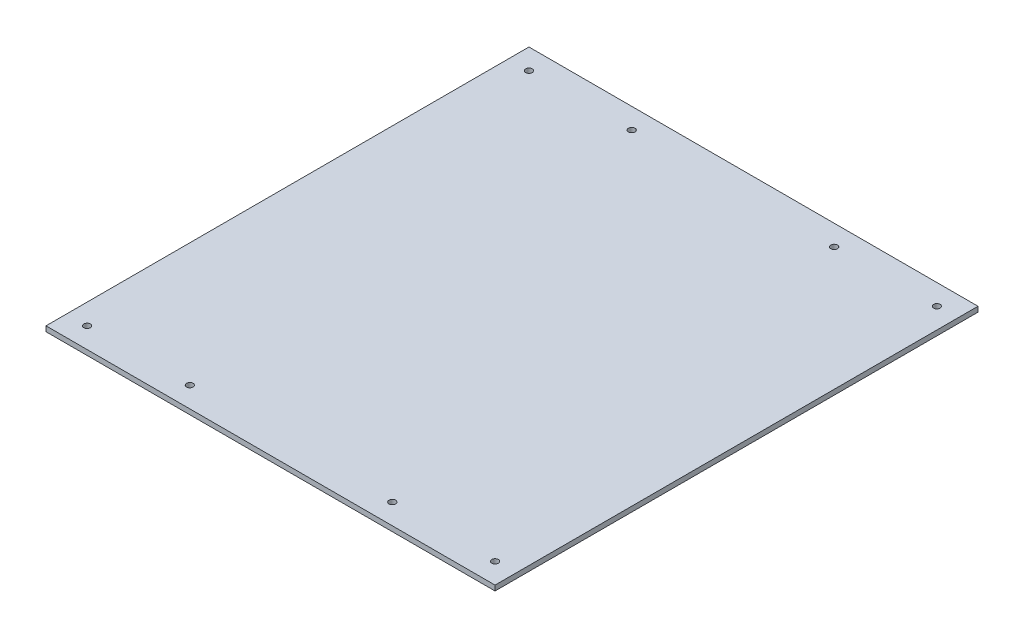
ISO-10303-21;
HEADER;
FILE_DESCRIPTION(('STEP AP214'),'2;1');
FILE_NAME('part.step','',(''),(''),'','','');
FILE_SCHEMA(('AUTOMOTIVE_DESIGN { 1 0 10303 214 1 1 1 1 }'));
ENDSEC;
DATA;
#1=APPLICATION_CONTEXT('core data for automotive mechanical design processes');
#2=APPLICATION_PROTOCOL_DEFINITION('international standard','automotive_design',2000,#1);
#3=PRODUCT_CONTEXT('',#1,'mechanical');
#4=PRODUCT('Part','Part','',(#3));
#5=PRODUCT_RELATED_PRODUCT_CATEGORY('part','',(#4));
#6=PRODUCT_DEFINITION_FORMATION('','',#4);
#7=PRODUCT_DEFINITION_CONTEXT('part definition',#1,'design');
#8=PRODUCT_DEFINITION('design','',#6,#7);
#9=PRODUCT_DEFINITION_SHAPE('','',#8);
#10=(LENGTH_UNIT() NAMED_UNIT(*) SI_UNIT(.MILLI.,.METRE.));
#11=(NAMED_UNIT(*) PLANE_ANGLE_UNIT() SI_UNIT($,.RADIAN.));
#12=(NAMED_UNIT(*) SI_UNIT($,.STERADIAN.) SOLID_ANGLE_UNIT());
#13=UNCERTAINTY_MEASURE_WITH_UNIT(LENGTH_MEASURE(1.E-05),#10,'distance_accuracy_value','');
#14=(GEOMETRIC_REPRESENTATION_CONTEXT(3) GLOBAL_UNCERTAINTY_ASSIGNED_CONTEXT((#13)) GLOBAL_UNIT_ASSIGNED_CONTEXT((#10,
#11,#12)) REPRESENTATION_CONTEXT('',''));
#15=CARTESIAN_POINT('',(0.,0.,0.));
#16=DIRECTION('',(0.,0.,1.));
#17=DIRECTION('',(1.,0.,0.));
#18=AXIS2_PLACEMENT_3D('',#15,#16,#17);
#19=CARTESIAN_POINT('',(218.5,5.,235.));
#20=DIRECTION('',(-1.,0.,0.));
#21=DIRECTION('',(0.,0.,1.));
#22=AXIS2_PLACEMENT_3D('',#19,#20,#21);
#23=PLANE('',#22);
#24=DIRECTION('',(0.,0.,-1.));
#25=VECTOR('',#24,1.);
#26=CARTESIAN_POINT('',(218.5,0.,235.));
#27=LINE('',#26,#25);
#28=CARTESIAN_POINT('',(218.5,0.,235.));
#29=VERTEX_POINT('',#28);
#30=CARTESIAN_POINT('',(218.5,0.,-235.));
#31=VERTEX_POINT('',#30);
#32=EDGE_CURVE('E98',#29,#31,#27,.T.);
#33=ORIENTED_EDGE('',*,*,#32,.T.);
#34=DIRECTION('',(0.,-1.,0.));
#35=VECTOR('',#34,1.);
#36=CARTESIAN_POINT('',(218.5,5.,-235.));
#37=LINE('',#36,#35);
#38=CARTESIAN_POINT('',(218.5,5.,-235.));
#39=VERTEX_POINT('',#38);
#40=EDGE_CURVE('E11',#39,#31,#37,.T.);
#41=ORIENTED_EDGE('',*,*,#40,.F.);
#42=DIRECTION('',(0.,0.,-1.));
#43=VECTOR('',#42,1.);
#44=CARTESIAN_POINT('',(218.5,5.,235.));
#45=LINE('',#44,#43);
#46=CARTESIAN_POINT('',(218.5,5.,235.));
#47=VERTEX_POINT('',#46);
#48=EDGE_CURVE('E85',#47,#39,#45,.T.);
#49=ORIENTED_EDGE('',*,*,#48,.F.);
#50=DIRECTION('',(0.,-1.,0.));
#51=VECTOR('',#50,1.);
#52=CARTESIAN_POINT('',(218.5,5.,235.));
#53=LINE('',#52,#51);
#54=EDGE_CURVE('E94',#47,#29,#53,.T.);
#55=ORIENTED_EDGE('',*,*,#54,.T.);
#56=EDGE_LOOP('',(#33,#41,#49,#55));
#57=FACE_BOUND('',#56,.T.);
#58=ADVANCED_FACE('F32',(#57),#23,.F.);
#59=CARTESIAN_POINT('',(-218.5,5.,-235.));
#60=DIRECTION('',(0.,0.,1.));
#61=DIRECTION('',(1.,0.,0.));
#62=AXIS2_PLACEMENT_3D('',#59,#60,#61);
#63=PLANE('',#62);
#64=DIRECTION('',(-1.,0.,0.));
#65=VECTOR('',#64,1.);
#66=CARTESIAN_POINT('',(-218.5,0.,-235.));
#67=LINE('',#66,#65);
#68=CARTESIAN_POINT('',(-218.5,0.,-235.));
#69=VERTEX_POINT('',#68);
#70=EDGE_CURVE('E89',#31,#69,#67,.T.);
#71=ORIENTED_EDGE('',*,*,#70,.T.);
#72=DIRECTION('',(0.,-1.,0.));
#73=VECTOR('',#72,1.);
#74=CARTESIAN_POINT('',(-218.5,5.,-235.));
#75=LINE('',#74,#73);
#76=CARTESIAN_POINT('',(-218.5,5.,-235.));
#77=VERTEX_POINT('',#76);
#78=EDGE_CURVE('E41',#77,#69,#75,.T.);
#79=ORIENTED_EDGE('',*,*,#78,.F.);
#80=DIRECTION('',(-1.,0.,0.));
#81=VECTOR('',#80,1.);
#82=CARTESIAN_POINT('',(-218.5,5.,-235.));
#83=LINE('',#82,#81);
#84=EDGE_CURVE('E80',#39,#77,#83,.T.);
#85=ORIENTED_EDGE('',*,*,#84,.F.);
#86=ORIENTED_EDGE('',*,*,#40,.T.);
#87=EDGE_LOOP('',(#71,#79,#85,#86));
#88=FACE_BOUND('',#87,.T.);
#89=ADVANCED_FACE('F88',(#88),#63,.F.);
#90=CARTESIAN_POINT('',(-218.5,5.,235.));
#91=DIRECTION('',(1.,0.,0.));
#92=DIRECTION('',(0.,0.,-1.));
#93=AXIS2_PLACEMENT_3D('',#90,#91,#92);
#94=PLANE('',#93);
#95=DIRECTION('',(0.,0.,1.));
#96=VECTOR('',#95,1.);
#97=CARTESIAN_POINT('',(-218.5,0.,235.));
#98=LINE('',#97,#96);
#99=CARTESIAN_POINT('',(-218.5,0.,235.));
#100=VERTEX_POINT('',#99);
#101=EDGE_CURVE('E67',#69,#100,#98,.T.);
#102=ORIENTED_EDGE('',*,*,#101,.T.);
#103=DIRECTION('',(0.,-1.,0.));
#104=VECTOR('',#103,1.);
#105=CARTESIAN_POINT('',(-218.5,5.,235.));
#106=LINE('',#105,#104);
#107=CARTESIAN_POINT('',(-218.5,5.,235.));
#108=VERTEX_POINT('',#107);
#109=EDGE_CURVE('E90',#108,#100,#106,.T.);
#110=ORIENTED_EDGE('',*,*,#109,.F.);
#111=DIRECTION('',(0.,0.,1.));
#112=VECTOR('',#111,1.);
#113=CARTESIAN_POINT('',(-218.5,5.,235.));
#114=LINE('',#113,#112);
#115=EDGE_CURVE('E83',#77,#108,#114,.T.);
#116=ORIENTED_EDGE('',*,*,#115,.F.);
#117=ORIENTED_EDGE('',*,*,#78,.T.);
#118=EDGE_LOOP('',(#102,#110,#116,#117));
#119=FACE_BOUND('',#118,.T.);
#120=ADVANCED_FACE('F92',(#119),#94,.F.);
#121=CARTESIAN_POINT('',(-218.5,5.,235.));
#122=DIRECTION('',(0.,0.,-1.));
#123=DIRECTION('',(-1.,0.,0.));
#124=AXIS2_PLACEMENT_3D('',#121,#122,#123);
#125=PLANE('',#124);
#126=DIRECTION('',(1.,0.,0.));
#127=VECTOR('',#126,1.);
#128=CARTESIAN_POINT('',(-218.5,0.,235.));
#129=LINE('',#128,#127);
#130=EDGE_CURVE('E73',#100,#29,#129,.T.);
#131=ORIENTED_EDGE('',*,*,#130,.T.);
#132=ORIENTED_EDGE('',*,*,#54,.F.);
#133=DIRECTION('',(1.,0.,0.));
#134=VECTOR('',#133,1.);
#135=CARTESIAN_POINT('',(-218.5,5.,235.));
#136=LINE('',#135,#134);
#137=EDGE_CURVE('E50',#108,#47,#136,.T.);
#138=ORIENTED_EDGE('',*,*,#137,.F.);
#139=ORIENTED_EDGE('',*,*,#109,.T.);
#140=EDGE_LOOP('',(#131,#132,#138,#139));
#141=FACE_BOUND('',#140,.T.);
#142=ADVANCED_FACE('F159',(#141),#125,.F.);
#143=CARTESIAN_POINT('',(0.,5.,0.));
#144=DIRECTION('',(0.,-1.,0.));
#145=DIRECTION('',(0.,0.,-1.));
#146=AXIS2_PLACEMENT_3D('',#143,#144,#145);
#147=PLANE('',#146);
#148=CARTESIAN_POINT('',(-198.5,5.,-215.));
#149=DIRECTION('',(0.,1.,0.));
#150=DIRECTION('',(0.,0.,1.));
#151=AXIS2_PLACEMENT_3D('',#148,#149,#150);
#152=CIRCLE('',#151,3.20000000000001);
#153=CARTESIAN_POINT('',(-198.5,5.,-211.8));
#154=VERTEX_POINT('',#153);
#155=EDGE_CURVE('E141',#154,#154,#152,.T.);
#156=ORIENTED_EDGE('',*,*,#155,.F.);
#157=EDGE_LOOP('',(#156));
#158=FACE_BOUND('',#157,.T.);
#159=CARTESIAN_POINT('',(-98.5,5.,-215.));
#160=DIRECTION('',(0.,1.,0.));
#161=DIRECTION('',(0.,0.,1.));
#162=AXIS2_PLACEMENT_3D('',#159,#160,#161);
#163=CIRCLE('',#162,3.19999999999999);
#164=CARTESIAN_POINT('',(-98.5,5.,-211.8));
#165=VERTEX_POINT('',#164);
#166=EDGE_CURVE('E131',#165,#165,#163,.T.);
#167=ORIENTED_EDGE('',*,*,#166,.F.);
#168=EDGE_LOOP('',(#167));
#169=FACE_BOUND('',#168,.T.);
#170=CARTESIAN_POINT('',(98.5,5.,-215.));
#171=DIRECTION('',(0.,1.,0.));
#172=DIRECTION('',(0.,0.,1.));
#173=AXIS2_PLACEMENT_3D('',#170,#171,#172);
#174=CIRCLE('',#173,3.19999999999999);
#175=CARTESIAN_POINT('',(98.5,5.,-211.8));
#176=VERTEX_POINT('',#175);
#177=EDGE_CURVE('E128',#176,#176,#174,.T.);
#178=ORIENTED_EDGE('',*,*,#177,.F.);
#179=EDGE_LOOP('',(#178));
#180=FACE_BOUND('',#179,.T.);
#181=CARTESIAN_POINT('',(198.5,5.,-215.));
#182=DIRECTION('',(0.,1.,0.));
#183=DIRECTION('',(0.,0.,1.));
#184=AXIS2_PLACEMENT_3D('',#181,#182,#183);
#185=CIRCLE('',#184,3.20000000000001);
#186=CARTESIAN_POINT('',(198.5,5.,-211.8));
#187=VERTEX_POINT('',#186);
#188=EDGE_CURVE('E125',#187,#187,#185,.T.);
#189=ORIENTED_EDGE('',*,*,#188,.F.);
#190=EDGE_LOOP('',(#189));
#191=FACE_BOUND('',#190,.T.);
#192=CARTESIAN_POINT('',(-198.5,5.,215.));
#193=DIRECTION('',(0.,1.,0.));
#194=DIRECTION('',(0.,0.,1.));
#195=AXIS2_PLACEMENT_3D('',#192,#193,#194);
#196=CIRCLE('',#195,3.20000000000001);
#197=CARTESIAN_POINT('',(-198.5,5.,218.2));
#198=VERTEX_POINT('',#197);
#199=EDGE_CURVE('E121',#198,#198,#196,.T.);
#200=ORIENTED_EDGE('',*,*,#199,.F.);
#201=EDGE_LOOP('',(#200));
#202=FACE_BOUND('',#201,.T.);
#203=CARTESIAN_POINT('',(-98.5,5.,215.));
#204=DIRECTION('',(0.,1.,0.));
#205=DIRECTION('',(0.,0.,1.));
#206=AXIS2_PLACEMENT_3D('',#203,#204,#205);
#207=CIRCLE('',#206,3.19999999999999);
#208=CARTESIAN_POINT('',(-98.5,5.,218.2));
#209=VERTEX_POINT('',#208);
#210=EDGE_CURVE('E117',#209,#209,#207,.T.);
#211=ORIENTED_EDGE('',*,*,#210,.F.);
#212=EDGE_LOOP('',(#211));
#213=FACE_BOUND('',#212,.T.);
#214=CARTESIAN_POINT('',(98.5,5.,215.));
#215=DIRECTION('',(0.,1.,0.));
#216=DIRECTION('',(0.,0.,1.));
#217=AXIS2_PLACEMENT_3D('',#214,#215,#216);
#218=CIRCLE('',#217,3.19999999999999);
#219=CARTESIAN_POINT('',(98.5,5.,218.2));
#220=VERTEX_POINT('',#219);
#221=EDGE_CURVE('E113',#220,#220,#218,.T.);
#222=ORIENTED_EDGE('',*,*,#221,.F.);
#223=EDGE_LOOP('',(#222));
#224=FACE_BOUND('',#223,.T.);
#225=CARTESIAN_POINT('',(198.5,5.,215.));
#226=DIRECTION('',(0.,1.,0.));
#227=DIRECTION('',(0.,0.,1.));
#228=AXIS2_PLACEMENT_3D('',#225,#226,#227);
#229=CIRCLE('',#228,3.20000000000001);
#230=CARTESIAN_POINT('',(198.5,5.,218.2));
#231=VERTEX_POINT('',#230);
#232=EDGE_CURVE('E109',#231,#231,#229,.T.);
#233=ORIENTED_EDGE('',*,*,#232,.F.);
#234=EDGE_LOOP('',(#233));
#235=FACE_BOUND('',#234,.T.);
#236=ORIENTED_EDGE('',*,*,#48,.T.);
#237=ORIENTED_EDGE('',*,*,#84,.T.);
#238=ORIENTED_EDGE('',*,*,#115,.T.);
#239=ORIENTED_EDGE('',*,*,#137,.T.);
#240=EDGE_LOOP('',(#236,#237,#238,#239));
#241=FACE_BOUND('',#240,.T.);
#242=ADVANCED_FACE('F81',(#158,#169,#180,#191,#202,#213,#224,#235,#241),#147,.F.);
#243=CARTESIAN_POINT('',(0.,0.,0.));
#244=DIRECTION('',(0.,-1.,0.));
#245=DIRECTION('',(0.,0.,-1.));
#246=AXIS2_PLACEMENT_3D('',#243,#244,#245);
#247=PLANE('',#246);
#248=CARTESIAN_POINT('',(-198.5,0.,-215.));
#249=DIRECTION('',(0.,-1.,0.));
#250=DIRECTION('',(0.,0.,-1.));
#251=AXIS2_PLACEMENT_3D('',#248,#249,#250);
#252=CIRCLE('',#251,3.20000000000001);
#253=CARTESIAN_POINT('',(-198.5,0.,-218.2));
#254=VERTEX_POINT('',#253);
#255=EDGE_CURVE('E35',#254,#254,#252,.T.);
#256=ORIENTED_EDGE('',*,*,#255,.F.);
#257=EDGE_LOOP('',(#256));
#258=FACE_BOUND('',#257,.T.);
#259=CARTESIAN_POINT('',(-98.5,0.,-215.));
#260=DIRECTION('',(0.,-1.,0.));
#261=DIRECTION('',(0.,0.,-1.));
#262=AXIS2_PLACEMENT_3D('',#259,#260,#261);
#263=CIRCLE('',#262,3.19999999999999);
#264=CARTESIAN_POINT('',(-98.5,0.,-218.2));
#265=VERTEX_POINT('',#264);
#266=EDGE_CURVE('E129',#265,#265,#263,.T.);
#267=ORIENTED_EDGE('',*,*,#266,.F.);
#268=EDGE_LOOP('',(#267));
#269=FACE_BOUND('',#268,.T.);
#270=CARTESIAN_POINT('',(98.5,0.,-215.));
#271=DIRECTION('',(0.,-1.,0.));
#272=DIRECTION('',(0.,0.,-1.));
#273=AXIS2_PLACEMENT_3D('',#270,#271,#272);
#274=CIRCLE('',#273,3.19999999999999);
#275=CARTESIAN_POINT('',(98.5,0.,-218.2));
#276=VERTEX_POINT('',#275);
#277=EDGE_CURVE('E126',#276,#276,#274,.T.);
#278=ORIENTED_EDGE('',*,*,#277,.F.);
#279=EDGE_LOOP('',(#278));
#280=FACE_BOUND('',#279,.T.);
#281=CARTESIAN_POINT('',(198.5,0.,-215.));
#282=DIRECTION('',(0.,-1.,0.));
#283=DIRECTION('',(0.,0.,-1.));
#284=AXIS2_PLACEMENT_3D('',#281,#282,#283);
#285=CIRCLE('',#284,3.20000000000001);
#286=CARTESIAN_POINT('',(198.5,0.,-218.2));
#287=VERTEX_POINT('',#286);
#288=EDGE_CURVE('E122',#287,#287,#285,.T.);
#289=ORIENTED_EDGE('',*,*,#288,.F.);
#290=EDGE_LOOP('',(#289));
#291=FACE_BOUND('',#290,.T.);
#292=CARTESIAN_POINT('',(-198.5,0.,215.));
#293=DIRECTION('',(0.,-1.,0.));
#294=DIRECTION('',(0.,0.,-1.));
#295=AXIS2_PLACEMENT_3D('',#292,#293,#294);
#296=CIRCLE('',#295,3.20000000000001);
#297=CARTESIAN_POINT('',(-198.5,0.,211.8));
#298=VERTEX_POINT('',#297);
#299=EDGE_CURVE('E118',#298,#298,#296,.T.);
#300=ORIENTED_EDGE('',*,*,#299,.F.);
#301=EDGE_LOOP('',(#300));
#302=FACE_BOUND('',#301,.T.);
#303=CARTESIAN_POINT('',(-98.5,0.,215.));
#304=DIRECTION('',(0.,-1.,0.));
#305=DIRECTION('',(0.,0.,-1.));
#306=AXIS2_PLACEMENT_3D('',#303,#304,#305);
#307=CIRCLE('',#306,3.19999999999999);
#308=CARTESIAN_POINT('',(-98.5,0.,211.8));
#309=VERTEX_POINT('',#308);
#310=EDGE_CURVE('E114',#309,#309,#307,.T.);
#311=ORIENTED_EDGE('',*,*,#310,.F.);
#312=EDGE_LOOP('',(#311));
#313=FACE_BOUND('',#312,.T.);
#314=CARTESIAN_POINT('',(98.5,0.,215.));
#315=DIRECTION('',(0.,-1.,0.));
#316=DIRECTION('',(0.,0.,-1.));
#317=AXIS2_PLACEMENT_3D('',#314,#315,#316);
#318=CIRCLE('',#317,3.19999999999999);
#319=CARTESIAN_POINT('',(98.5,0.,211.8));
#320=VERTEX_POINT('',#319);
#321=EDGE_CURVE('E110',#320,#320,#318,.T.);
#322=ORIENTED_EDGE('',*,*,#321,.F.);
#323=EDGE_LOOP('',(#322));
#324=FACE_BOUND('',#323,.T.);
#325=CARTESIAN_POINT('',(198.5,0.,215.));
#326=DIRECTION('',(0.,-1.,0.));
#327=DIRECTION('',(0.,0.,-1.));
#328=AXIS2_PLACEMENT_3D('',#325,#326,#327);
#329=CIRCLE('',#328,3.20000000000001);
#330=CARTESIAN_POINT('',(198.5,0.,211.8));
#331=VERTEX_POINT('',#330);
#332=EDGE_CURVE('E101',#331,#331,#329,.T.);
#333=ORIENTED_EDGE('',*,*,#332,.F.);
#334=EDGE_LOOP('',(#333));
#335=FACE_BOUND('',#334,.T.);
#336=ORIENTED_EDGE('',*,*,#32,.F.);
#337=ORIENTED_EDGE('',*,*,#130,.F.);
#338=ORIENTED_EDGE('',*,*,#101,.F.);
#339=ORIENTED_EDGE('',*,*,#70,.F.);
#340=EDGE_LOOP('',(#336,#337,#338,#339));
#341=FACE_BOUND('',#340,.T.);
#342=ADVANCED_FACE('F158',(#258,#269,#280,#291,#302,#313,#324,#335,#341),#247,.T.);
#343=CARTESIAN_POINT('',(198.5,5.,215.));
#344=DIRECTION('',(0.,1.,0.));
#345=DIRECTION('',(0.,0.,1.));
#346=AXIS2_PLACEMENT_3D('',#343,#344,#345);
#347=CYLINDRICAL_SURFACE('',#346,3.20000000000001);
#348=ORIENTED_EDGE('',*,*,#332,.T.);
#349=EDGE_LOOP('',(#348));
#350=FACE_BOUND('',#349,.T.);
#351=ORIENTED_EDGE('',*,*,#232,.T.);
#352=EDGE_LOOP('',(#351));
#353=FACE_BOUND('',#352,.T.);
#354=ADVANCED_FACE('F155',(#350,#353),#347,.F.);
#355=CARTESIAN_POINT('',(98.5,5.,215.));
#356=DIRECTION('',(0.,1.,0.));
#357=DIRECTION('',(0.,0.,1.));
#358=AXIS2_PLACEMENT_3D('',#355,#356,#357);
#359=CYLINDRICAL_SURFACE('',#358,3.19999999999999);
#360=ORIENTED_EDGE('',*,*,#321,.T.);
#361=EDGE_LOOP('',(#360));
#362=FACE_BOUND('',#361,.T.);
#363=ORIENTED_EDGE('',*,*,#221,.T.);
#364=EDGE_LOOP('',(#363));
#365=FACE_BOUND('',#364,.T.);
#366=ADVANCED_FACE('F208',(#362,#365),#359,.F.);
#367=CARTESIAN_POINT('',(-98.5,5.,215.));
#368=DIRECTION('',(0.,1.,0.));
#369=DIRECTION('',(0.,0.,1.));
#370=AXIS2_PLACEMENT_3D('',#367,#368,#369);
#371=CYLINDRICAL_SURFACE('',#370,3.19999999999999);
#372=ORIENTED_EDGE('',*,*,#310,.T.);
#373=EDGE_LOOP('',(#372));
#374=FACE_BOUND('',#373,.T.);
#375=ORIENTED_EDGE('',*,*,#210,.T.);
#376=EDGE_LOOP('',(#375));
#377=FACE_BOUND('',#376,.T.);
#378=ADVANCED_FACE('F217',(#374,#377),#371,.F.);
#379=CARTESIAN_POINT('',(-198.5,5.,215.));
#380=DIRECTION('',(0.,1.,0.));
#381=DIRECTION('',(0.,0.,1.));
#382=AXIS2_PLACEMENT_3D('',#379,#380,#381);
#383=CYLINDRICAL_SURFACE('',#382,3.20000000000001);
#384=ORIENTED_EDGE('',*,*,#299,.T.);
#385=EDGE_LOOP('',(#384));
#386=FACE_BOUND('',#385,.T.);
#387=ORIENTED_EDGE('',*,*,#199,.T.);
#388=EDGE_LOOP('',(#387));
#389=FACE_BOUND('',#388,.T.);
#390=ADVANCED_FACE('F227',(#386,#389),#383,.F.);
#391=CARTESIAN_POINT('',(198.5,5.,-215.));
#392=DIRECTION('',(0.,1.,0.));
#393=DIRECTION('',(0.,0.,1.));
#394=AXIS2_PLACEMENT_3D('',#391,#392,#393);
#395=CYLINDRICAL_SURFACE('',#394,3.20000000000001);
#396=ORIENTED_EDGE('',*,*,#288,.T.);
#397=EDGE_LOOP('',(#396));
#398=FACE_BOUND('',#397,.T.);
#399=ORIENTED_EDGE('',*,*,#188,.T.);
#400=EDGE_LOOP('',(#399));
#401=FACE_BOUND('',#400,.T.);
#402=ADVANCED_FACE('F237',(#398,#401),#395,.F.);
#403=CARTESIAN_POINT('',(98.5,5.,-215.));
#404=DIRECTION('',(0.,1.,0.));
#405=DIRECTION('',(0.,0.,1.));
#406=AXIS2_PLACEMENT_3D('',#403,#404,#405);
#407=CYLINDRICAL_SURFACE('',#406,3.19999999999999);
#408=ORIENTED_EDGE('',*,*,#277,.T.);
#409=EDGE_LOOP('',(#408));
#410=FACE_BOUND('',#409,.T.);
#411=ORIENTED_EDGE('',*,*,#177,.T.);
#412=EDGE_LOOP('',(#411));
#413=FACE_BOUND('',#412,.T.);
#414=ADVANCED_FACE('F247',(#410,#413),#407,.F.);
#415=CARTESIAN_POINT('',(-98.5,5.,-215.));
#416=DIRECTION('',(0.,1.,0.));
#417=DIRECTION('',(0.,0.,1.));
#418=AXIS2_PLACEMENT_3D('',#415,#416,#417);
#419=CYLINDRICAL_SURFACE('',#418,3.19999999999999);
#420=ORIENTED_EDGE('',*,*,#266,.T.);
#421=EDGE_LOOP('',(#420));
#422=FACE_BOUND('',#421,.T.);
#423=ORIENTED_EDGE('',*,*,#166,.T.);
#424=EDGE_LOOP('',(#423));
#425=FACE_BOUND('',#424,.T.);
#426=ADVANCED_FACE('F257',(#422,#425),#419,.F.);
#427=CARTESIAN_POINT('',(-198.5,5.,-215.));
#428=DIRECTION('',(0.,1.,0.));
#429=DIRECTION('',(0.,0.,1.));
#430=AXIS2_PLACEMENT_3D('',#427,#428,#429);
#431=CYLINDRICAL_SURFACE('',#430,3.20000000000001);
#432=ORIENTED_EDGE('',*,*,#255,.T.);
#433=EDGE_LOOP('',(#432));
#434=FACE_BOUND('',#433,.T.);
#435=ORIENTED_EDGE('',*,*,#155,.T.);
#436=EDGE_LOOP('',(#435));
#437=FACE_BOUND('',#436,.T.);
#438=ADVANCED_FACE('F267',(#434,#437),#431,.F.);
#439=CLOSED_SHELL('',(#58,#89,#120,#142,#242,#342,#354,#366,#378,#390,#402,#414,#426,#438));
#440=MANIFOLD_SOLID_BREP('B2',#439);
#441=ADVANCED_BREP_SHAPE_REPRESENTATION('',(#18,#440),#14);
#442=SHAPE_DEFINITION_REPRESENTATION(#9,#441);
ENDSEC;
END-ISO-10303-21;
